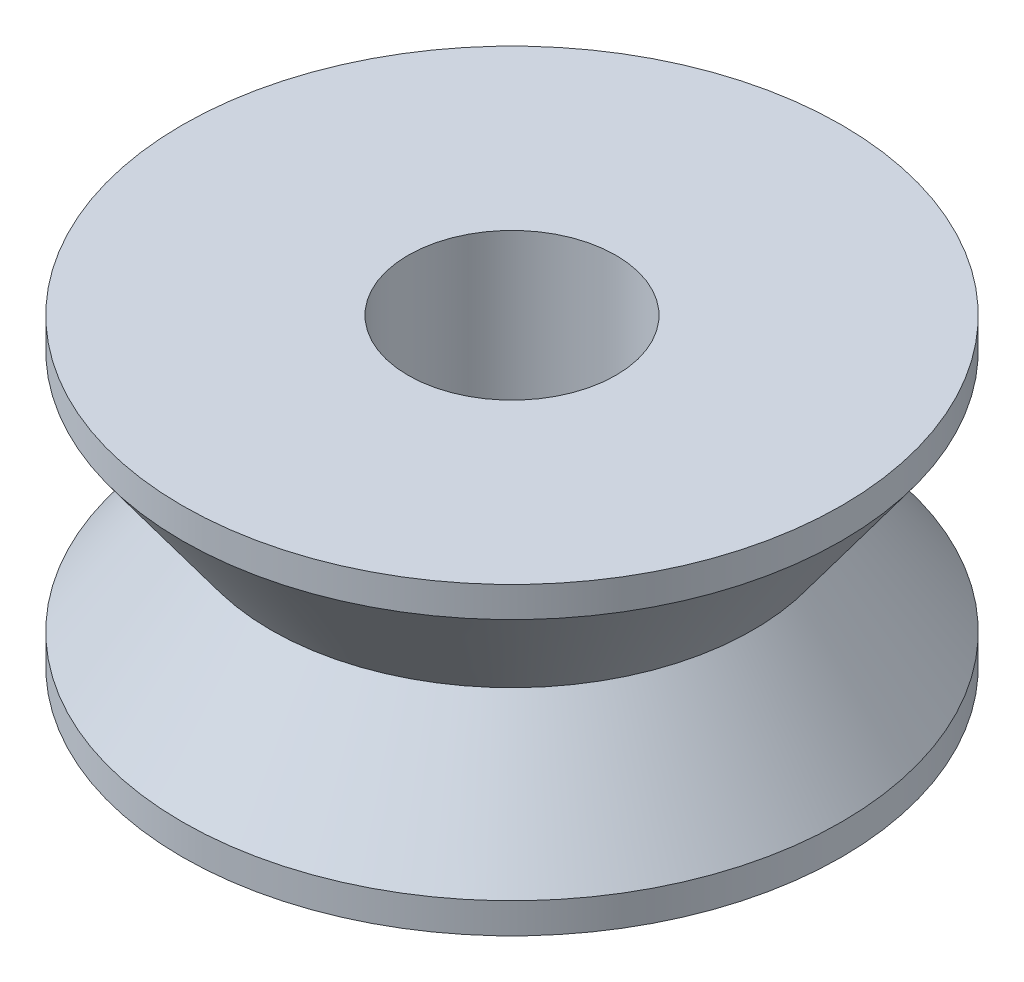
ISO-10303-21;
HEADER;
FILE_DESCRIPTION(('STEP AP214'),'2;1');
FILE_NAME('part.step','',(''),(''),'','','');
FILE_SCHEMA(('AUTOMOTIVE_DESIGN { 1 0 10303 214 1 1 1 1 }'));
ENDSEC;
DATA;
#1=APPLICATION_CONTEXT('core data for automotive mechanical design processes');
#2=APPLICATION_PROTOCOL_DEFINITION('international standard','automotive_design',2000,#1);
#3=PRODUCT_CONTEXT('',#1,'mechanical');
#4=PRODUCT('Part','Part','',(#3));
#5=PRODUCT_RELATED_PRODUCT_CATEGORY('part','',(#4));
#6=PRODUCT_DEFINITION_FORMATION('','',#4);
#7=PRODUCT_DEFINITION_CONTEXT('part definition',#1,'design');
#8=PRODUCT_DEFINITION('design','',#6,#7);
#9=PRODUCT_DEFINITION_SHAPE('','',#8);
#10=(LENGTH_UNIT() NAMED_UNIT(*) SI_UNIT(.MILLI.,.METRE.));
#11=(NAMED_UNIT(*) PLANE_ANGLE_UNIT() SI_UNIT($,.RADIAN.));
#12=(NAMED_UNIT(*) SI_UNIT($,.STERADIAN.) SOLID_ANGLE_UNIT());
#13=UNCERTAINTY_MEASURE_WITH_UNIT(LENGTH_MEASURE(1.E-05),#10,'distance_accuracy_value','');
#14=(GEOMETRIC_REPRESENTATION_CONTEXT(3) GLOBAL_UNCERTAINTY_ASSIGNED_CONTEXT((#13)) GLOBAL_UNIT_ASSIGNED_CONTEXT((#10,
#11,#12)) REPRESENTATION_CONTEXT('',''));
#15=CARTESIAN_POINT('',(0.,0.,0.));
#16=DIRECTION('',(0.,0.,1.));
#17=DIRECTION('',(1.,0.,0.));
#18=AXIS2_PLACEMENT_3D('',#15,#16,#17);
#19=CARTESIAN_POINT('',(3.33066907387547E-13,6.00000000000001,1.11022302462516E-13));
#20=DIRECTION('',(0.,1.,0.));
#21=DIRECTION('',(0.,0.,1.00000000000001));
#22=AXIS2_PLACEMENT_3D('',#19,#20,#21);
#23=PLANE('',#22);
#24=CARTESIAN_POINT('',(3.33066907387547E-13,6.00000000000001,1.11022302462516E-13));
#25=DIRECTION('',(0.,1.,0.));
#26=DIRECTION('',(0.,0.,1.00000000000001));
#27=AXIS2_PLACEMENT_3D('',#24,#25,#26);
#28=CIRCLE('',#27,2.05);
#29=CARTESIAN_POINT('',(3.34204885987788E-13,6.00000000000001,2.05000000000014));
#30=VERTEX_POINT('',#29);
#31=EDGE_CURVE('E58',#30,#30,#28,.T.);
#32=ORIENTED_EDGE('',*,*,#31,.F.);
#33=EDGE_LOOP('',(#32));
#34=FACE_BOUND('',#33,.T.);
#35=CARTESIAN_POINT('',(3.33066907387547E-13,6.00000000000001,1.11022302462516E-13));
#36=DIRECTION('',(0.,-1.,0.));
#37=DIRECTION('',(0.,0.,-1.00000000000001));
#38=AXIS2_PLACEMENT_3D('',#35,#36,#37);
#39=CIRCLE('',#38,6.5);
#40=CARTESIAN_POINT('',(3.29458682557515E-13,6.00000000000001,-6.49999999999998));
#41=VERTEX_POINT('',#40);
#42=EDGE_CURVE('E10',#41,#41,#39,.T.);
#43=ORIENTED_EDGE('',*,*,#42,.F.);
#44=EDGE_LOOP('',(#43));
#45=FACE_BOUND('',#44,.T.);
#46=ADVANCED_FACE('F36',(#34,#45),#23,.T.);
#47=CARTESIAN_POINT('',(0.,0.,0.));
#48=DIRECTION('',(0.,-1.,0.));
#49=DIRECTION('',(0.,0.,-1.00000000000001));
#50=AXIS2_PLACEMENT_3D('',#47,#48,#49);
#51=CYLINDRICAL_SURFACE('',#50,6.5);
#52=ORIENTED_EDGE('',*,*,#42,.T.);
#53=EDGE_LOOP('',(#52));
#54=FACE_BOUND('',#53,.T.);
#55=CARTESIAN_POINT('',(2.22044604925031E-13,5.40000000000007,1.11022302462516E-13));
#56=DIRECTION('',(0.,-1.,0.));
#57=DIRECTION('',(0.,0.,-1.00000000000001));
#58=AXIS2_PLACEMENT_3D('',#55,#56,#57);
#59=CIRCLE('',#58,6.5);
#60=CARTESIAN_POINT('',(2.18436380095E-13,5.40000000000007,-6.49999999999998));
#61=VERTEX_POINT('',#60);
#62=EDGE_CURVE('E42',#61,#61,#59,.T.);
#63=ORIENTED_EDGE('',*,*,#62,.F.);
#64=EDGE_LOOP('',(#63));
#65=FACE_BOUND('',#64,.T.);
#66=ADVANCED_FACE('F69',(#54,#65),#51,.T.);
#67=CARTESIAN_POINT('',(1.11022302462516E-13,3.,0.));
#68=DIRECTION('',(0.,1.,0.));
#69=DIRECTION('',(0.,0.,1.00000000000001));
#70=AXIS2_PLACEMENT_3D('',#67,#68,#69);
#71=CONICAL_SURFACE('',#70,4.75,0.630033909545915);
#72=ORIENTED_EDGE('',*,*,#62,.T.);
#73=EDGE_LOOP('',(#72));
#74=FACE_BOUND('',#73,.T.);
#75=CARTESIAN_POINT('',(1.11022302462516E-13,3.,0.));
#76=DIRECTION('',(0.,-1.,0.));
#77=DIRECTION('',(0.,0.,-1.00000000000001));
#78=AXIS2_PLACEMENT_3D('',#75,#76,#77);
#79=CIRCLE('',#78,4.75);
#80=CARTESIAN_POINT('',(1.08385522779031E-13,3.,-4.75000000000006));
#81=VERTEX_POINT('',#80);
#82=EDGE_CURVE('E46',#81,#81,#79,.T.);
#83=ORIENTED_EDGE('',*,*,#82,.F.);
#84=EDGE_LOOP('',(#83));
#85=FACE_BOUND('',#84,.T.);
#86=ADVANCED_FACE('F73',(#74,#85),#71,.T.);
#87=CARTESIAN_POINT('',(0.,0.599999999999934,0.));
#88=DIRECTION('',(0.,-1.,0.));
#89=DIRECTION('',(0.,0.,-1.00000000000001));
#90=AXIS2_PLACEMENT_3D('',#87,#88,#89);
#91=CONICAL_SURFACE('',#90,6.5,0.630033909545915);
#92=ORIENTED_EDGE('',*,*,#82,.T.);
#93=EDGE_LOOP('',(#92));
#94=FACE_BOUND('',#93,.T.);
#95=CARTESIAN_POINT('',(0.,0.599999999999934,0.));
#96=DIRECTION('',(0.,-1.,0.));
#97=DIRECTION('',(0.,0.,-1.00000000000001));
#98=AXIS2_PLACEMENT_3D('',#95,#96,#97);
#99=CIRCLE('',#98,6.5);
#100=CARTESIAN_POINT('',(0.,0.599999999999935,-6.50000000000009));
#101=VERTEX_POINT('',#100);
#102=EDGE_CURVE('E50',#101,#101,#99,.T.);
#103=ORIENTED_EDGE('',*,*,#102,.F.);
#104=EDGE_LOOP('',(#103));
#105=FACE_BOUND('',#104,.T.);
#106=ADVANCED_FACE('F77',(#94,#105),#91,.T.);
#107=CARTESIAN_POINT('',(0.,0.,0.));
#108=DIRECTION('',(0.,-1.,0.));
#109=DIRECTION('',(0.,0.,-1.00000000000001));
#110=AXIS2_PLACEMENT_3D('',#107,#108,#109);
#111=CYLINDRICAL_SURFACE('',#110,6.5);
#112=ORIENTED_EDGE('',*,*,#102,.T.);
#113=EDGE_LOOP('',(#112));
#114=FACE_BOUND('',#113,.T.);
#115=CARTESIAN_POINT('',(0.,0.,0.));
#116=DIRECTION('',(0.,-1.,0.));
#117=DIRECTION('',(0.,0.,-1.00000000000001));
#118=AXIS2_PLACEMENT_3D('',#115,#116,#117);
#119=CIRCLE('',#118,6.5);
#120=CARTESIAN_POINT('',(0.,0.,-6.50000000000009));
#121=VERTEX_POINT('',#120);
#122=EDGE_CURVE('E55',#121,#121,#119,.T.);
#123=ORIENTED_EDGE('',*,*,#122,.F.);
#124=EDGE_LOOP('',(#123));
#125=FACE_BOUND('',#124,.T.);
#126=ADVANCED_FACE('F83',(#114,#125),#111,.T.);
#127=CARTESIAN_POINT('',(6.50000000000017,-4.71844785465692E-13,-1.11022302462516E-13));
#128=DIRECTION('',(0.,-1.,0.));
#129=DIRECTION('',(0.,0.,-1.00000000000001));
#130=AXIS2_PLACEMENT_3D('',#127,#128,#129);
#131=PLANE('',#130);
#132=CARTESIAN_POINT('',(0.,0.,0.));
#133=DIRECTION('',(0.,-1.,0.));
#134=DIRECTION('',(0.,0.,-1.00000000000001));
#135=AXIS2_PLACEMENT_3D('',#132,#133,#134);
#136=CIRCLE('',#135,2.05);
#137=CARTESIAN_POINT('',(0.,0.,-2.05000000000003));
#138=VERTEX_POINT('',#137);
#139=EDGE_CURVE('E59',#138,#138,#136,.F.);
#140=ORIENTED_EDGE('',*,*,#139,.T.);
#141=EDGE_LOOP('',(#140));
#142=FACE_BOUND('',#141,.T.);
#143=ORIENTED_EDGE('',*,*,#122,.T.);
#144=EDGE_LOOP('',(#143));
#145=FACE_BOUND('',#144,.T.);
#146=ADVANCED_FACE('F87',(#142,#145),#131,.T.);
#147=CARTESIAN_POINT('',(0.,-0.000999999999917733,0.));
#148=DIRECTION('',(0.,1.,0.));
#149=DIRECTION('',(0.,0.,1.00000000000001));
#150=AXIS2_PLACEMENT_3D('',#147,#148,#149);
#151=CYLINDRICAL_SURFACE('',#150,2.05);
#152=ORIENTED_EDGE('',*,*,#139,.F.);
#153=EDGE_LOOP('',(#152));
#154=FACE_BOUND('',#153,.T.);
#155=ORIENTED_EDGE('',*,*,#31,.T.);
#156=EDGE_LOOP('',(#155));
#157=FACE_BOUND('',#156,.T.);
#158=ADVANCED_FACE('F65',(#154,#157),#151,.F.);
#159=CLOSED_SHELL('',(#46,#66,#86,#106,#126,#146,#158));
#160=MANIFOLD_SOLID_BREP('B2',#159);
#161=ADVANCED_BREP_SHAPE_REPRESENTATION('',(#18,#160),#14);
#162=SHAPE_DEFINITION_REPRESENTATION(#9,#161);
ENDSEC;
END-ISO-10303-21;
